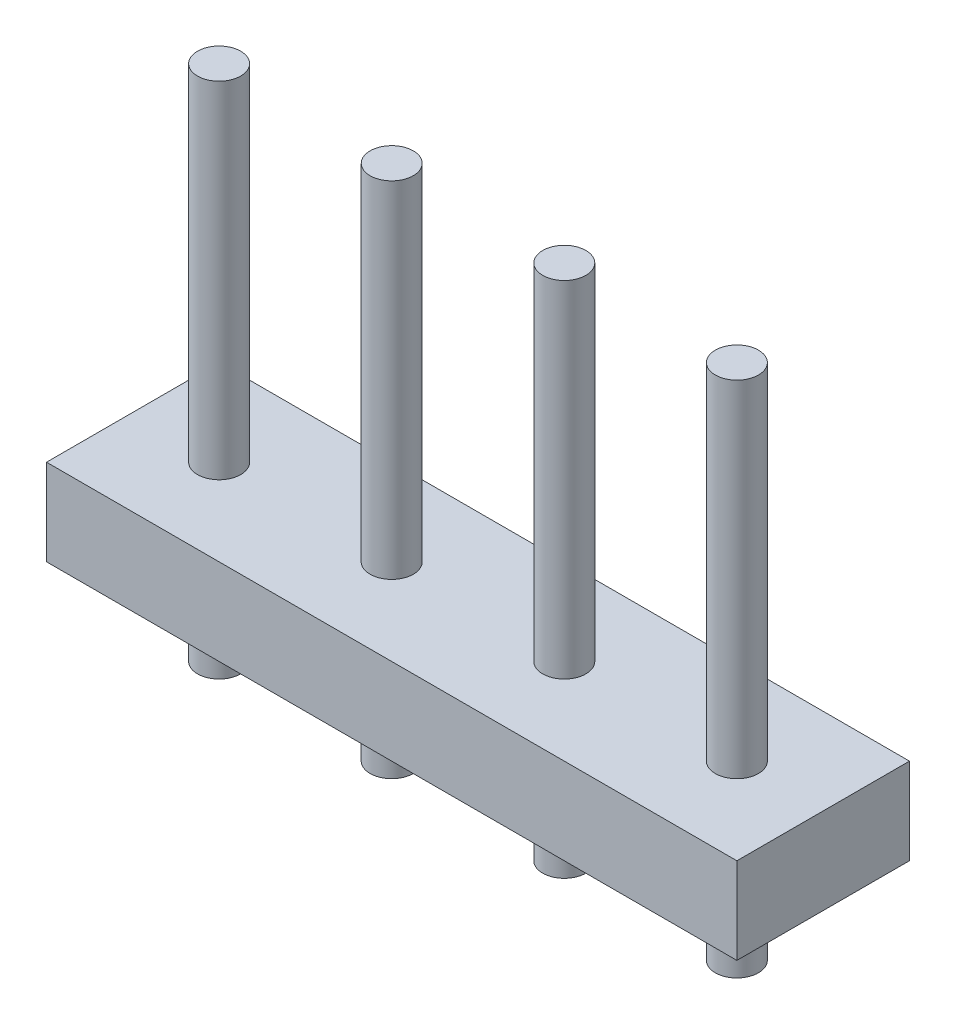
ISO-10303-21;
HEADER;
FILE_DESCRIPTION(('STEP AP214'),'2;1');
FILE_NAME('part.step','',(''),(''),'','','');
FILE_SCHEMA(('AUTOMOTIVE_DESIGN { 1 0 10303 214 1 1 1 1 }'));
ENDSEC;
DATA;
#1=APPLICATION_CONTEXT('core data for automotive mechanical design processes');
#2=APPLICATION_PROTOCOL_DEFINITION('international standard','automotive_design',2000,#1);
#3=PRODUCT_CONTEXT('',#1,'mechanical');
#4=PRODUCT('Part','Part','',(#3));
#5=PRODUCT_RELATED_PRODUCT_CATEGORY('part','',(#4));
#6=PRODUCT_DEFINITION_FORMATION('','',#4);
#7=PRODUCT_DEFINITION_CONTEXT('part definition',#1,'design');
#8=PRODUCT_DEFINITION('design','',#6,#7);
#9=PRODUCT_DEFINITION_SHAPE('','',#8);
#10=(LENGTH_UNIT() NAMED_UNIT(*) SI_UNIT(.MILLI.,.METRE.));
#11=(NAMED_UNIT(*) PLANE_ANGLE_UNIT() SI_UNIT($,.RADIAN.));
#12=(NAMED_UNIT(*) SI_UNIT($,.STERADIAN.) SOLID_ANGLE_UNIT());
#13=UNCERTAINTY_MEASURE_WITH_UNIT(LENGTH_MEASURE(1.E-05),#10,'distance_accuracy_value','');
#14=(GEOMETRIC_REPRESENTATION_CONTEXT(3) GLOBAL_UNCERTAINTY_ASSIGNED_CONTEXT((#13)) GLOBAL_UNIT_ASSIGNED_CONTEXT((#10,
#11,#12)) REPRESENTATION_CONTEXT('',''));
#15=CARTESIAN_POINT('',(0.,0.,0.));
#16=DIRECTION('',(0.,0.,1.));
#17=DIRECTION('',(1.,0.,0.));
#18=AXIS2_PLACEMENT_3D('',#15,#16,#17);
#19=CARTESIAN_POINT('',(-5.08,1.27,-1.27));
#20=DIRECTION('',(1.,0.,0.));
#21=DIRECTION('',(0.,0.,-1.));
#22=AXIS2_PLACEMENT_3D('',#19,#20,#21);
#23=PLANE('',#22);
#24=DIRECTION('',(0.,0.,1.));
#25=VECTOR('',#24,1.);
#26=CARTESIAN_POINT('',(-5.08,0.,-1.27));
#27=LINE('',#26,#25);
#28=CARTESIAN_POINT('',(-5.08,0.,-1.27));
#29=VERTEX_POINT('',#28);
#30=CARTESIAN_POINT('',(-5.08,0.,1.27));
#31=VERTEX_POINT('',#30);
#32=EDGE_CURVE('E100',#29,#31,#27,.T.);
#33=ORIENTED_EDGE('',*,*,#32,.T.);
#34=DIRECTION('',(0.,-1.,0.));
#35=VECTOR('',#34,1.);
#36=CARTESIAN_POINT('',(-5.08,1.27,1.27));
#37=LINE('',#36,#35);
#38=CARTESIAN_POINT('',(-5.08,1.27,1.27));
#39=VERTEX_POINT('',#38);
#40=EDGE_CURVE('E91',#39,#31,#37,.T.);
#41=ORIENTED_EDGE('',*,*,#40,.F.);
#42=DIRECTION('',(0.,0.,1.));
#43=VECTOR('',#42,1.);
#44=CARTESIAN_POINT('',(-5.08,1.27,-1.27));
#45=LINE('',#44,#43);
#46=CARTESIAN_POINT('',(-5.08,1.27,-1.27));
#47=VERTEX_POINT('',#46);
#48=EDGE_CURVE('E85',#47,#39,#45,.T.);
#49=ORIENTED_EDGE('',*,*,#48,.F.);
#50=DIRECTION('',(0.,-1.,0.));
#51=VECTOR('',#50,1.);
#52=CARTESIAN_POINT('',(-5.08,1.27,-1.27));
#53=LINE('',#52,#51);
#54=EDGE_CURVE('E96',#47,#29,#53,.T.);
#55=ORIENTED_EDGE('',*,*,#54,.T.);
#56=EDGE_LOOP('',(#33,#41,#49,#55));
#57=FACE_BOUND('',#56,.T.);
#58=ADVANCED_FACE('F31',(#57),#23,.F.);
#59=CARTESIAN_POINT('',(-5.08,1.27,1.27));
#60=DIRECTION('',(0.,0.,-1.));
#61=DIRECTION('',(-1.,0.,0.));
#62=AXIS2_PLACEMENT_3D('',#59,#60,#61);
#63=PLANE('',#62);
#64=DIRECTION('',(1.,0.,0.));
#65=VECTOR('',#64,1.);
#66=CARTESIAN_POINT('',(-5.08,0.,1.27));
#67=LINE('',#66,#65);
#68=CARTESIAN_POINT('',(5.08,0.,1.27));
#69=VERTEX_POINT('',#68);
#70=EDGE_CURVE('E90',#31,#69,#67,.T.);
#71=ORIENTED_EDGE('',*,*,#70,.T.);
#72=DIRECTION('',(0.,-1.,0.));
#73=VECTOR('',#72,1.);
#74=CARTESIAN_POINT('',(5.08,1.27,1.27));
#75=LINE('',#74,#73);
#76=CARTESIAN_POINT('',(5.08,1.27,1.27));
#77=VERTEX_POINT('',#76);
#78=EDGE_CURVE('E88',#77,#69,#75,.T.);
#79=ORIENTED_EDGE('',*,*,#78,.F.);
#80=DIRECTION('',(1.,0.,0.));
#81=VECTOR('',#80,1.);
#82=CARTESIAN_POINT('',(-5.08,1.27,1.27));
#83=LINE('',#82,#81);
#84=EDGE_CURVE('E80',#39,#77,#83,.T.);
#85=ORIENTED_EDGE('',*,*,#84,.F.);
#86=ORIENTED_EDGE('',*,*,#40,.T.);
#87=EDGE_LOOP('',(#71,#79,#85,#86));
#88=FACE_BOUND('',#87,.T.);
#89=ADVANCED_FACE('F89',(#88),#63,.F.);
#90=CARTESIAN_POINT('',(5.08,1.27,-1.27));
#91=DIRECTION('',(-1.,0.,0.));
#92=DIRECTION('',(0.,0.,1.));
#93=AXIS2_PLACEMENT_3D('',#90,#91,#92);
#94=PLANE('',#93);
#95=DIRECTION('',(0.,0.,-1.));
#96=VECTOR('',#95,1.);
#97=CARTESIAN_POINT('',(5.08,0.,-1.27));
#98=LINE('',#97,#96);
#99=CARTESIAN_POINT('',(5.08,0.,-1.27));
#100=VERTEX_POINT('',#99);
#101=EDGE_CURVE('E66',#69,#100,#98,.T.);
#102=ORIENTED_EDGE('',*,*,#101,.T.);
#103=DIRECTION('',(0.,-1.,0.));
#104=VECTOR('',#103,1.);
#105=CARTESIAN_POINT('',(5.08,1.27,-1.27));
#106=LINE('',#105,#104);
#107=CARTESIAN_POINT('',(5.08,1.27,-1.27));
#108=VERTEX_POINT('',#107);
#109=EDGE_CURVE('E92',#108,#100,#106,.T.);
#110=ORIENTED_EDGE('',*,*,#109,.F.);
#111=DIRECTION('',(0.,0.,-1.));
#112=VECTOR('',#111,1.);
#113=CARTESIAN_POINT('',(5.08,1.27,-1.27));
#114=LINE('',#113,#112);
#115=EDGE_CURVE('E83',#77,#108,#114,.T.);
#116=ORIENTED_EDGE('',*,*,#115,.F.);
#117=ORIENTED_EDGE('',*,*,#78,.T.);
#118=EDGE_LOOP('',(#102,#110,#116,#117));
#119=FACE_BOUND('',#118,.T.);
#120=ADVANCED_FACE('F94',(#119),#94,.F.);
#121=CARTESIAN_POINT('',(-5.08,1.27,-1.27));
#122=DIRECTION('',(0.,0.,1.));
#123=DIRECTION('',(1.,0.,0.));
#124=AXIS2_PLACEMENT_3D('',#121,#122,#123);
#125=PLANE('',#124);
#126=DIRECTION('',(-1.,0.,0.));
#127=VECTOR('',#126,1.);
#128=CARTESIAN_POINT('',(-5.08,0.,-1.27));
#129=LINE('',#128,#127);
#130=EDGE_CURVE('E72',#100,#29,#129,.T.);
#131=ORIENTED_EDGE('',*,*,#130,.T.);
#132=ORIENTED_EDGE('',*,*,#54,.F.);
#133=DIRECTION('',(-1.,0.,0.));
#134=VECTOR('',#133,1.);
#135=CARTESIAN_POINT('',(-5.08,1.27,-1.27));
#136=LINE('',#135,#134);
#137=EDGE_CURVE('E49',#108,#47,#136,.T.);
#138=ORIENTED_EDGE('',*,*,#137,.F.);
#139=ORIENTED_EDGE('',*,*,#109,.T.);
#140=EDGE_LOOP('',(#131,#132,#138,#139));
#141=FACE_BOUND('',#140,.T.);
#142=ADVANCED_FACE('F153',(#141),#125,.F.);
#143=CARTESIAN_POINT('',(-5.08,1.27,1.27));
#144=DIRECTION('',(0.,1.,0.));
#145=DIRECTION('',(0.,0.,1.));
#146=AXIS2_PLACEMENT_3D('',#143,#144,#145);
#147=PLANE('',#146);
#148=CARTESIAN_POINT('',(3.81,1.27,0.));
#149=DIRECTION('',(0.,1.,0.));
#150=DIRECTION('',(0.,0.,1.));
#151=AXIS2_PLACEMENT_3D('',#148,#149,#150);
#152=CIRCLE('',#151,0.317499999999999);
#153=CARTESIAN_POINT('',(3.81,1.27,0.317499999999999));
#154=VERTEX_POINT('',#153);
#155=EDGE_CURVE('E11',#154,#154,#152,.T.);
#156=ORIENTED_EDGE('',*,*,#155,.F.);
#157=EDGE_LOOP('',(#156));
#158=FACE_BOUND('',#157,.T.);
#159=CARTESIAN_POINT('',(1.27,1.27,0.));
#160=DIRECTION('',(0.,1.,0.));
#161=DIRECTION('',(0.,0.,1.));
#162=AXIS2_PLACEMENT_3D('',#159,#160,#161);
#163=CIRCLE('',#162,0.3175);
#164=CARTESIAN_POINT('',(1.27,1.27,0.3175));
#165=VERTEX_POINT('',#164);
#166=EDGE_CURVE('E40',#165,#165,#163,.T.);
#167=ORIENTED_EDGE('',*,*,#166,.F.);
#168=EDGE_LOOP('',(#167));
#169=FACE_BOUND('',#168,.T.);
#170=CARTESIAN_POINT('',(-3.81,1.27,0.));
#171=DIRECTION('',(0.,1.,0.));
#172=DIRECTION('',(0.,0.,1.));
#173=AXIS2_PLACEMENT_3D('',#170,#171,#172);
#174=CIRCLE('',#173,0.317499999999999);
#175=CARTESIAN_POINT('',(-3.81,1.27,0.317499999999999));
#176=VERTEX_POINT('',#175);
#177=EDGE_CURVE('E135',#176,#176,#174,.T.);
#178=ORIENTED_EDGE('',*,*,#177,.F.);
#179=EDGE_LOOP('',(#178));
#180=FACE_BOUND('',#179,.T.);
#181=CARTESIAN_POINT('',(-1.27,1.27,0.));
#182=DIRECTION('',(0.,1.,0.));
#183=DIRECTION('',(0.,0.,1.));
#184=AXIS2_PLACEMENT_3D('',#181,#182,#183);
#185=CIRCLE('',#184,0.3175);
#186=CARTESIAN_POINT('',(-1.27,1.27,0.3175));
#187=VERTEX_POINT('',#186);
#188=EDGE_CURVE('E110',#187,#187,#185,.T.);
#189=ORIENTED_EDGE('',*,*,#188,.F.);
#190=EDGE_LOOP('',(#189));
#191=FACE_BOUND('',#190,.T.);
#192=ORIENTED_EDGE('',*,*,#48,.T.);
#193=ORIENTED_EDGE('',*,*,#84,.T.);
#194=ORIENTED_EDGE('',*,*,#115,.T.);
#195=ORIENTED_EDGE('',*,*,#137,.T.);
#196=EDGE_LOOP('',(#192,#193,#194,#195));
#197=FACE_BOUND('',#196,.T.);
#198=ADVANCED_FACE('F81',(#158,#169,#180,#191,#197),#147,.T.);
#199=CARTESIAN_POINT('',(-5.08,0.,1.27));
#200=DIRECTION('',(0.,1.,0.));
#201=DIRECTION('',(0.,0.,1.));
#202=AXIS2_PLACEMENT_3D('',#199,#200,#201);
#203=PLANE('',#202);
#204=CARTESIAN_POINT('',(3.81,0.,0.));
#205=DIRECTION('',(0.,1.,0.));
#206=DIRECTION('',(0.,0.,1.));
#207=AXIS2_PLACEMENT_3D('',#204,#205,#206);
#208=CIRCLE('',#207,0.317499999999999);
#209=CARTESIAN_POINT('',(3.81,0.,0.317499999999999));
#210=VERTEX_POINT('',#209);
#211=EDGE_CURVE('E34',#210,#210,#208,.T.);
#212=ORIENTED_EDGE('',*,*,#211,.T.);
#213=EDGE_LOOP('',(#212));
#214=FACE_BOUND('',#213,.T.);
#215=CARTESIAN_POINT('',(1.27,0.,0.));
#216=DIRECTION('',(0.,1.,0.));
#217=DIRECTION('',(0.,0.,1.));
#218=AXIS2_PLACEMENT_3D('',#215,#216,#217);
#219=CIRCLE('',#218,0.3175);
#220=CARTESIAN_POINT('',(1.27,0.,0.3175));
#221=VERTEX_POINT('',#220);
#222=EDGE_CURVE('E118',#221,#221,#219,.T.);
#223=ORIENTED_EDGE('',*,*,#222,.T.);
#224=EDGE_LOOP('',(#223));
#225=FACE_BOUND('',#224,.T.);
#226=CARTESIAN_POINT('',(-3.81,0.,0.));
#227=DIRECTION('',(0.,1.,0.));
#228=DIRECTION('',(0.,0.,1.));
#229=AXIS2_PLACEMENT_3D('',#226,#227,#228);
#230=CIRCLE('',#229,0.317499999999999);
#231=CARTESIAN_POINT('',(-3.81,0.,0.317499999999999));
#232=VERTEX_POINT('',#231);
#233=EDGE_CURVE('E114',#232,#232,#230,.T.);
#234=ORIENTED_EDGE('',*,*,#233,.T.);
#235=EDGE_LOOP('',(#234));
#236=FACE_BOUND('',#235,.T.);
#237=CARTESIAN_POINT('',(-1.27,0.,0.));
#238=DIRECTION('',(0.,1.,0.));
#239=DIRECTION('',(0.,0.,1.));
#240=AXIS2_PLACEMENT_3D('',#237,#238,#239);
#241=CIRCLE('',#240,0.3175);
#242=CARTESIAN_POINT('',(-1.27,0.,0.3175));
#243=VERTEX_POINT('',#242);
#244=EDGE_CURVE('E103',#243,#243,#241,.T.);
#245=ORIENTED_EDGE('',*,*,#244,.T.);
#246=EDGE_LOOP('',(#245));
#247=FACE_BOUND('',#246,.T.);
#248=ORIENTED_EDGE('',*,*,#32,.F.);
#249=ORIENTED_EDGE('',*,*,#130,.F.);
#250=ORIENTED_EDGE('',*,*,#101,.F.);
#251=ORIENTED_EDGE('',*,*,#70,.F.);
#252=EDGE_LOOP('',(#248,#249,#250,#251));
#253=FACE_BOUND('',#252,.T.);
#254=ADVANCED_FACE('F152',(#214,#225,#236,#247,#253),#203,.F.);
#255=CARTESIAN_POINT('',(-1.27,-1.27,0.));
#256=DIRECTION('',(0.,1.,0.));
#257=DIRECTION('',(0.,0.,1.));
#258=AXIS2_PLACEMENT_3D('',#255,#256,#257);
#259=PLANE('',#258);
#260=CARTESIAN_POINT('',(-1.27,-1.27,0.));
#261=DIRECTION('',(0.,1.,0.));
#262=DIRECTION('',(0.,0.,1.));
#263=AXIS2_PLACEMENT_3D('',#260,#261,#262);
#264=CIRCLE('',#263,0.3175);
#265=CARTESIAN_POINT('',(-1.27,-1.27,0.3175));
#266=VERTEX_POINT('',#265);
#267=EDGE_CURVE('E113',#266,#266,#264,.T.);
#268=ORIENTED_EDGE('',*,*,#267,.F.);
#269=EDGE_LOOP('',(#268));
#270=FACE_BOUND('',#269,.T.);
#271=ADVANCED_FACE('F160',(#270),#259,.F.);
#272=CARTESIAN_POINT('',(-1.27,-1.27,0.));
#273=DIRECTION('',(0.,1.,0.));
#274=DIRECTION('',(0.,0.,1.));
#275=AXIS2_PLACEMENT_3D('',#272,#273,#274);
#276=CYLINDRICAL_SURFACE('',#275,0.3175);
#277=ORIENTED_EDGE('',*,*,#267,.T.);
#278=EDGE_LOOP('',(#277));
#279=FACE_BOUND('',#278,.T.);
#280=ORIENTED_EDGE('',*,*,#244,.F.);
#281=EDGE_LOOP('',(#280));
#282=FACE_BOUND('',#281,.T.);
#283=ADVANCED_FACE('F203',(#279,#282),#276,.T.);
#284=ORIENTED_EDGE('',*,*,#188,.T.);
#285=EDGE_LOOP('',(#284));
#286=FACE_BOUND('',#285,.T.);
#287=CARTESIAN_POINT('',(-1.27,6.35,0.));
#288=DIRECTION('',(0.,1.,0.));
#289=DIRECTION('',(0.,0.,1.));
#290=AXIS2_PLACEMENT_3D('',#287,#288,#289);
#291=CIRCLE('',#290,0.3175);
#292=CARTESIAN_POINT('',(-1.27,6.35,0.3175));
#293=VERTEX_POINT('',#292);
#294=EDGE_CURVE('E116',#293,#293,#291,.T.);
#295=ORIENTED_EDGE('',*,*,#294,.F.);
#296=EDGE_LOOP('',(#295));
#297=FACE_BOUND('',#296,.T.);
#298=ADVANCED_FACE('F148',(#286,#297),#276,.T.);
#299=CARTESIAN_POINT('',(-1.27,6.35,0.));
#300=DIRECTION('',(0.,1.,0.));
#301=DIRECTION('',(0.,0.,1.));
#302=AXIS2_PLACEMENT_3D('',#299,#300,#301);
#303=PLANE('',#302);
#304=ORIENTED_EDGE('',*,*,#294,.T.);
#305=EDGE_LOOP('',(#304));
#306=FACE_BOUND('',#305,.T.);
#307=ADVANCED_FACE('F221',(#306),#303,.T.);
#308=CARTESIAN_POINT('',(-3.81,-1.27,0.));
#309=DIRECTION('',(0.,1.,0.));
#310=DIRECTION('',(0.,0.,1.));
#311=AXIS2_PLACEMENT_3D('',#308,#309,#310);
#312=PLANE('',#311);
#313=CARTESIAN_POINT('',(-3.81,-1.27,0.));
#314=DIRECTION('',(0.,1.,0.));
#315=DIRECTION('',(0.,0.,1.));
#316=AXIS2_PLACEMENT_3D('',#313,#314,#315);
#317=CIRCLE('',#316,0.317499999999999);
#318=CARTESIAN_POINT('',(-3.81,-1.27,0.317499999999999));
#319=VERTEX_POINT('',#318);
#320=EDGE_CURVE('E117',#319,#319,#317,.T.);
#321=ORIENTED_EDGE('',*,*,#320,.F.);
#322=EDGE_LOOP('',(#321));
#323=FACE_BOUND('',#322,.T.);
#324=ADVANCED_FACE('F229',(#323),#312,.F.);
#325=CARTESIAN_POINT('',(-3.81,-1.27,0.));
#326=DIRECTION('',(0.,1.,0.));
#327=DIRECTION('',(0.,0.,1.));
#328=AXIS2_PLACEMENT_3D('',#325,#326,#327);
#329=CYLINDRICAL_SURFACE('',#328,0.317499999999999);
#330=ORIENTED_EDGE('',*,*,#320,.T.);
#331=EDGE_LOOP('',(#330));
#332=FACE_BOUND('',#331,.T.);
#333=ORIENTED_EDGE('',*,*,#233,.F.);
#334=EDGE_LOOP('',(#333));
#335=FACE_BOUND('',#334,.T.);
#336=ADVANCED_FACE('F239',(#332,#335),#329,.T.);
#337=ORIENTED_EDGE('',*,*,#177,.T.);
#338=EDGE_LOOP('',(#337));
#339=FACE_BOUND('',#338,.T.);
#340=CARTESIAN_POINT('',(-3.81,6.35,0.));
#341=DIRECTION('',(0.,1.,0.));
#342=DIRECTION('',(0.,0.,1.));
#343=AXIS2_PLACEMENT_3D('',#340,#341,#342);
#344=CIRCLE('',#343,0.317499999999999);
#345=CARTESIAN_POINT('',(-3.81,6.35,0.317499999999999));
#346=VERTEX_POINT('',#345);
#347=EDGE_CURVE('E120',#346,#346,#344,.T.);
#348=ORIENTED_EDGE('',*,*,#347,.F.);
#349=EDGE_LOOP('',(#348));
#350=FACE_BOUND('',#349,.T.);
#351=ADVANCED_FACE('F249',(#339,#350),#329,.T.);
#352=CARTESIAN_POINT('',(-3.81,6.35,0.));
#353=DIRECTION('',(0.,1.,0.));
#354=DIRECTION('',(0.,0.,1.));
#355=AXIS2_PLACEMENT_3D('',#352,#353,#354);
#356=PLANE('',#355);
#357=ORIENTED_EDGE('',*,*,#347,.T.);
#358=EDGE_LOOP('',(#357));
#359=FACE_BOUND('',#358,.T.);
#360=ADVANCED_FACE('F259',(#359),#356,.T.);
#361=CARTESIAN_POINT('',(1.27,-1.27,0.));
#362=DIRECTION('',(0.,1.,0.));
#363=DIRECTION('',(0.,0.,1.));
#364=AXIS2_PLACEMENT_3D('',#361,#362,#363);
#365=PLANE('',#364);
#366=CARTESIAN_POINT('',(1.27,-1.27,0.));
#367=DIRECTION('',(0.,1.,0.));
#368=DIRECTION('',(0.,0.,1.));
#369=AXIS2_PLACEMENT_3D('',#366,#367,#368);
#370=CIRCLE('',#369,0.3175);
#371=CARTESIAN_POINT('',(1.27,-1.27,0.3175));
#372=VERTEX_POINT('',#371);
#373=EDGE_CURVE('E121',#372,#372,#370,.T.);
#374=ORIENTED_EDGE('',*,*,#373,.F.);
#375=EDGE_LOOP('',(#374));
#376=FACE_BOUND('',#375,.T.);
#377=ADVANCED_FACE('F268',(#376),#365,.F.);
#378=CARTESIAN_POINT('',(1.27,-1.27,0.));
#379=DIRECTION('',(0.,1.,0.));
#380=DIRECTION('',(0.,0.,1.));
#381=AXIS2_PLACEMENT_3D('',#378,#379,#380);
#382=CYLINDRICAL_SURFACE('',#381,0.3175);
#383=ORIENTED_EDGE('',*,*,#373,.T.);
#384=EDGE_LOOP('',(#383));
#385=FACE_BOUND('',#384,.T.);
#386=ORIENTED_EDGE('',*,*,#222,.F.);
#387=EDGE_LOOP('',(#386));
#388=FACE_BOUND('',#387,.T.);
#389=ADVANCED_FACE('F278',(#385,#388),#382,.T.);
#390=ORIENTED_EDGE('',*,*,#166,.T.);
#391=EDGE_LOOP('',(#390));
#392=FACE_BOUND('',#391,.T.);
#393=CARTESIAN_POINT('',(1.27,6.35,0.));
#394=DIRECTION('',(0.,1.,0.));
#395=DIRECTION('',(0.,0.,1.));
#396=AXIS2_PLACEMENT_3D('',#393,#394,#395);
#397=CIRCLE('',#396,0.3175);
#398=CARTESIAN_POINT('',(1.27,6.35,0.3175));
#399=VERTEX_POINT('',#398);
#400=EDGE_CURVE('E127',#399,#399,#397,.T.);
#401=ORIENTED_EDGE('',*,*,#400,.F.);
#402=EDGE_LOOP('',(#401));
#403=FACE_BOUND('',#402,.T.);
#404=ADVANCED_FACE('F288',(#392,#403),#382,.T.);
#405=CARTESIAN_POINT('',(1.27,6.35,0.));
#406=DIRECTION('',(0.,1.,0.));
#407=DIRECTION('',(0.,0.,1.));
#408=AXIS2_PLACEMENT_3D('',#405,#406,#407);
#409=PLANE('',#408);
#410=ORIENTED_EDGE('',*,*,#400,.T.);
#411=EDGE_LOOP('',(#410));
#412=FACE_BOUND('',#411,.T.);
#413=ADVANCED_FACE('F297',(#412),#409,.T.);
#414=CARTESIAN_POINT('',(3.81,-1.27,0.));
#415=DIRECTION('',(0.,1.,0.));
#416=DIRECTION('',(0.,0.,1.));
#417=AXIS2_PLACEMENT_3D('',#414,#415,#416);
#418=PLANE('',#417);
#419=CARTESIAN_POINT('',(3.81,-1.27,0.));
#420=DIRECTION('',(0.,1.,0.));
#421=DIRECTION('',(0.,0.,1.));
#422=AXIS2_PLACEMENT_3D('',#419,#420,#421);
#423=CIRCLE('',#422,0.317499999999999);
#424=CARTESIAN_POINT('',(3.81,-1.27,0.317499999999999));
#425=VERTEX_POINT('',#424);
#426=EDGE_CURVE('E353',#425,#425,#423,.T.);
#427=ORIENTED_EDGE('',*,*,#426,.F.);
#428=EDGE_LOOP('',(#427));
#429=FACE_BOUND('',#428,.T.);
#430=ADVANCED_FACE('F306',(#429),#418,.F.);
#431=CARTESIAN_POINT('',(3.81,-1.27,0.));
#432=DIRECTION('',(0.,1.,0.));
#433=DIRECTION('',(0.,0.,1.));
#434=AXIS2_PLACEMENT_3D('',#431,#432,#433);
#435=CYLINDRICAL_SURFACE('',#434,0.317499999999999);
#436=ORIENTED_EDGE('',*,*,#426,.T.);
#437=EDGE_LOOP('',(#436));
#438=FACE_BOUND('',#437,.T.);
#439=ORIENTED_EDGE('',*,*,#211,.F.);
#440=EDGE_LOOP('',(#439));
#441=FACE_BOUND('',#440,.T.);
#442=ADVANCED_FACE('F316',(#438,#441),#435,.T.);
#443=ORIENTED_EDGE('',*,*,#155,.T.);
#444=EDGE_LOOP('',(#443));
#445=FACE_BOUND('',#444,.T.);
#446=CARTESIAN_POINT('',(3.81,6.35,0.));
#447=DIRECTION('',(0.,1.,0.));
#448=DIRECTION('',(0.,0.,1.));
#449=AXIS2_PLACEMENT_3D('',#446,#447,#448);
#450=CIRCLE('',#449,0.317499999999999);
#451=CARTESIAN_POINT('',(3.81,6.35,0.317499999999999));
#452=VERTEX_POINT('',#451);
#453=EDGE_CURVE('E351',#452,#452,#450,.T.);
#454=ORIENTED_EDGE('',*,*,#453,.F.);
#455=EDGE_LOOP('',(#454));
#456=FACE_BOUND('',#455,.T.);
#457=ADVANCED_FACE('F326',(#445,#456),#435,.T.);
#458=CARTESIAN_POINT('',(3.81,6.35,0.));
#459=DIRECTION('',(0.,1.,0.));
#460=DIRECTION('',(0.,0.,1.));
#461=AXIS2_PLACEMENT_3D('',#458,#459,#460);
#462=PLANE('',#461);
#463=ORIENTED_EDGE('',*,*,#453,.T.);
#464=EDGE_LOOP('',(#463));
#465=FACE_BOUND('',#464,.T.);
#466=ADVANCED_FACE('F336',(#465),#462,.T.);
#467=CLOSED_SHELL('',(#58,#89,#120,#142,#198,#254,#271,#283,#298,#307,#324,#336,#351,#360,#377,
#389,#404,#413,#430,#442,#457,#466));
#468=MANIFOLD_SOLID_BREP('B2',#467);
#469=ADVANCED_BREP_SHAPE_REPRESENTATION('',(#18,#468),#14);
#470=SHAPE_DEFINITION_REPRESENTATION(#9,#469);
ENDSEC;
END-ISO-10303-21;
